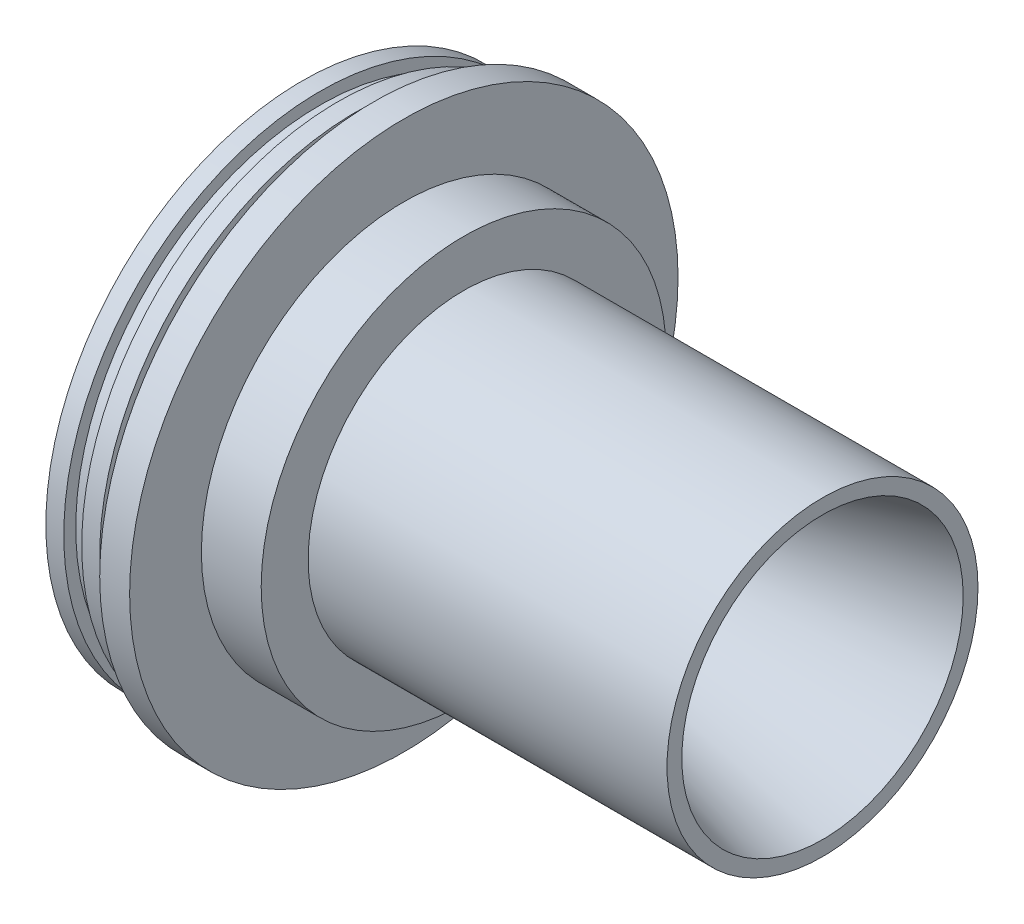
ISO-10303-21;
HEADER;
FILE_DESCRIPTION(('STEP AP214'),'2;1');
FILE_NAME('part.step','',(''),(''),'','','');
FILE_SCHEMA(('AUTOMOTIVE_DESIGN { 1 0 10303 214 1 1 1 1 }'));
ENDSEC;
DATA;
#1=APPLICATION_CONTEXT('core data for automotive mechanical design processes');
#2=APPLICATION_PROTOCOL_DEFINITION('international standard','automotive_design',2000,#1);
#3=PRODUCT_CONTEXT('',#1,'mechanical');
#4=PRODUCT('Part','Part','',(#3));
#5=PRODUCT_RELATED_PRODUCT_CATEGORY('part','',(#4));
#6=PRODUCT_DEFINITION_FORMATION('','',#4);
#7=PRODUCT_DEFINITION_CONTEXT('part definition',#1,'design');
#8=PRODUCT_DEFINITION('design','',#6,#7);
#9=PRODUCT_DEFINITION_SHAPE('','',#8);
#10=(LENGTH_UNIT() NAMED_UNIT(*) SI_UNIT(.MILLI.,.METRE.));
#11=(NAMED_UNIT(*) PLANE_ANGLE_UNIT() SI_UNIT($,.RADIAN.));
#12=(NAMED_UNIT(*) SI_UNIT($,.STERADIAN.) SOLID_ANGLE_UNIT());
#13=UNCERTAINTY_MEASURE_WITH_UNIT(LENGTH_MEASURE(1.E-05),#10,'distance_accuracy_value','');
#14=(GEOMETRIC_REPRESENTATION_CONTEXT(3) GLOBAL_UNCERTAINTY_ASSIGNED_CONTEXT((#13)) GLOBAL_UNIT_ASSIGNED_CONTEXT((#10,
#11,#12)) REPRESENTATION_CONTEXT('',''));
#15=CARTESIAN_POINT('',(0.,0.,0.));
#16=DIRECTION('',(0.,0.,1.));
#17=DIRECTION('',(1.,0.,0.));
#18=AXIS2_PLACEMENT_3D('',#15,#16,#17);
#19=CARTESIAN_POINT('',(-87.,42.86,0.));
#20=DIRECTION('',(-1.,0.,0.));
#21=DIRECTION('',(0.,0.,1.));
#22=AXIS2_PLACEMENT_3D('',#19,#20,#21);
#23=PLANE('',#22);
#24=CARTESIAN_POINT('',(-87.,0.,0.));
#25=DIRECTION('',(1.,0.,0.));
#26=DIRECTION('',(0.,0.,-1.));
#27=AXIS2_PLACEMENT_3D('',#24,#25,#26);
#28=CIRCLE('',#27,41.080611396612);
#29=CARTESIAN_POINT('',(-87.,0.,-41.080611396612));
#30=VERTEX_POINT('',#29);
#31=EDGE_CURVE('E10',#30,#30,#28,.T.);
#32=ORIENTED_EDGE('',*,*,#31,.T.);
#33=EDGE_LOOP('',(#32));
#34=FACE_BOUND('',#33,.T.);
#35=CARTESIAN_POINT('',(-87.,0.,0.));
#36=DIRECTION('',(1.,0.,0.));
#37=DIRECTION('',(0.,0.,-1.));
#38=AXIS2_PLACEMENT_3D('',#35,#36,#37);
#39=CIRCLE('',#38,42.86);
#40=CARTESIAN_POINT('',(-87.,0.,-42.86));
#41=VERTEX_POINT('',#40);
#42=EDGE_CURVE('E112',#41,#41,#39,.T.);
#43=ORIENTED_EDGE('',*,*,#42,.F.);
#44=EDGE_LOOP('',(#43));
#45=FACE_BOUND('',#44,.T.);
#46=ADVANCED_FACE('F37',(#34,#45),#23,.T.);
#47=CARTESIAN_POINT('',(-87.,0.,0.));
#48=DIRECTION('',(-1.,0.,0.));
#49=DIRECTION('',(0.,0.,1.));
#50=AXIS2_PLACEMENT_3D('',#47,#48,#49);
#51=CONICAL_SURFACE('',#50,41.080611396612,0.785398163397443);
#52=CARTESIAN_POINT('',(-60.8927868855894,0.,0.));
#53=DIRECTION('',(1.,0.,0.));
#54=DIRECTION('',(0.,0.,-1.));
#55=AXIS2_PLACEMENT_3D('',#52,#53,#54);
#56=CIRCLE('',#55,14.9733982822017);
#57=CARTESIAN_POINT('',(-60.8927868855894,0.,-14.9733982822017));
#58=VERTEX_POINT('',#57);
#59=EDGE_CURVE('E44',#58,#58,#56,.T.);
#60=ORIENTED_EDGE('',*,*,#59,.T.);
#61=EDGE_LOOP('',(#60));
#62=FACE_BOUND('',#61,.T.);
#63=ORIENTED_EDGE('',*,*,#31,.F.);
#64=EDGE_LOOP('',(#63));
#65=FACE_BOUND('',#64,.T.);
#66=ADVANCED_FACE('F121',(#62,#65),#51,.F.);
#67=CARTESIAN_POINT('',(-50.2861851677912,0.,0.));
#68=DIRECTION('',(1.,0.,0.));
#69=DIRECTION('',(0.,0.,-1.));
#70=AXIS2_PLACEMENT_3D('',#67,#68,#69);
#71=TOROIDAL_SURFACE('',#70,25.58,15.);
#72=CARTESIAN_POINT('',(-46.4038994912535,0.,0.));
#73=DIRECTION('',(1.,0.,0.));
#74=DIRECTION('',(0.,0.,-1.));
#75=AXIS2_PLACEMENT_3D('',#72,#73,#74);
#76=CIRCLE('',#75,11.0911126056639);
#77=CARTESIAN_POINT('',(-46.4038994912535,0.,-11.0911126056639));
#78=VERTEX_POINT('',#77);
#79=EDGE_CURVE('E49',#78,#78,#76,.T.);
#80=ORIENTED_EDGE('',*,*,#79,.T.);
#81=EDGE_LOOP('',(#80));
#82=FACE_BOUND('',#81,.T.);
#83=ORIENTED_EDGE('',*,*,#59,.F.);
#84=EDGE_LOOP('',(#83));
#85=FACE_BOUND('',#84,.T.);
#86=ADVANCED_FACE('F125',(#82,#85),#71,.T.);
#87=CARTESIAN_POINT('',(-46.4038994912535,0.,0.));
#88=DIRECTION('',(1.,0.,0.));
#89=DIRECTION('',(0.,0.,-1.));
#90=AXIS2_PLACEMENT_3D('',#87,#88,#89);
#91=CONICAL_SURFACE('',#90,11.0911126056639,0.261799387799143);
#92=CARTESIAN_POINT('',(0.,0.,0.));
#93=DIRECTION('',(1.,0.,0.));
#94=DIRECTION('',(0.,0.,-1.));
#95=AXIS2_PLACEMENT_3D('',#92,#93,#94);
#96=CIRCLE('',#95,23.525);
#97=CARTESIAN_POINT('',(0.,0.,-23.525));
#98=VERTEX_POINT('',#97);
#99=EDGE_CURVE('E54',#98,#98,#96,.T.);
#100=ORIENTED_EDGE('',*,*,#99,.T.);
#101=EDGE_LOOP('',(#100));
#102=FACE_BOUND('',#101,.T.);
#103=ORIENTED_EDGE('',*,*,#79,.F.);
#104=EDGE_LOOP('',(#103));
#105=FACE_BOUND('',#104,.T.);
#106=ADVANCED_FACE('F129',(#102,#105),#91,.F.);
#107=CARTESIAN_POINT('',(0.,23.525,0.));
#108=DIRECTION('',(1.,0.,0.));
#109=DIRECTION('',(0.,0.,-1.));
#110=AXIS2_PLACEMENT_3D('',#107,#108,#109);
#111=PLANE('',#110);
#112=CARTESIAN_POINT('',(0.,0.,0.));
#113=DIRECTION('',(1.,0.,0.));
#114=DIRECTION('',(0.,0.,-1.));
#115=AXIS2_PLACEMENT_3D('',#112,#113,#114);
#116=CIRCLE('',#115,26.);
#117=CARTESIAN_POINT('',(0.,0.,-26.));
#118=VERTEX_POINT('',#117);
#119=EDGE_CURVE('E60',#118,#118,#116,.T.);
#120=ORIENTED_EDGE('',*,*,#119,.T.);
#121=EDGE_LOOP('',(#120));
#122=FACE_BOUND('',#121,.T.);
#123=ORIENTED_EDGE('',*,*,#99,.F.);
#124=EDGE_LOOP('',(#123));
#125=FACE_BOUND('',#124,.T.);
#126=ADVANCED_FACE('F136',(#122,#125),#111,.T.);
#127=CARTESIAN_POINT('',(0.,0.,0.));
#128=DIRECTION('',(1.,0.,0.));
#129=DIRECTION('',(0.,0.,-1.));
#130=AXIS2_PLACEMENT_3D('',#127,#128,#129);
#131=CYLINDRICAL_SURFACE('',#130,26.);
#132=CARTESIAN_POINT('',(-60.,0.,0.));
#133=DIRECTION('',(1.,0.,0.));
#134=DIRECTION('',(0.,0.,-1.));
#135=AXIS2_PLACEMENT_3D('',#132,#133,#134);
#136=CIRCLE('',#135,26.);
#137=CARTESIAN_POINT('',(-60.,0.,-26.));
#138=VERTEX_POINT('',#137);
#139=EDGE_CURVE('E64',#138,#138,#136,.T.);
#140=ORIENTED_EDGE('',*,*,#139,.T.);
#141=EDGE_LOOP('',(#140));
#142=FACE_BOUND('',#141,.T.);
#143=ORIENTED_EDGE('',*,*,#119,.F.);
#144=EDGE_LOOP('',(#143));
#145=FACE_BOUND('',#144,.T.);
#146=ADVANCED_FACE('F140',(#142,#145),#131,.T.);
#147=CARTESIAN_POINT('',(-60.,33.85,0.));
#148=DIRECTION('',(1.,0.,0.));
#149=DIRECTION('',(0.,0.,-1.));
#150=AXIS2_PLACEMENT_3D('',#147,#148,#149);
#151=PLANE('',#150);
#152=CARTESIAN_POINT('',(-60.,0.,0.));
#153=DIRECTION('',(1.,0.,0.));
#154=DIRECTION('',(0.,0.,-1.));
#155=AXIS2_PLACEMENT_3D('',#152,#153,#154);
#156=CIRCLE('',#155,33.85);
#157=CARTESIAN_POINT('',(-60.,0.,-33.85));
#158=VERTEX_POINT('',#157);
#159=EDGE_CURVE('E68',#158,#158,#156,.T.);
#160=ORIENTED_EDGE('',*,*,#159,.T.);
#161=EDGE_LOOP('',(#160));
#162=FACE_BOUND('',#161,.T.);
#163=ORIENTED_EDGE('',*,*,#139,.F.);
#164=EDGE_LOOP('',(#163));
#165=FACE_BOUND('',#164,.T.);
#166=ADVANCED_FACE('F144',(#162,#165),#151,.T.);
#167=CARTESIAN_POINT('',(0.,0.,0.));
#168=DIRECTION('',(1.,0.,0.));
#169=DIRECTION('',(0.,0.,-1.));
#170=AXIS2_PLACEMENT_3D('',#167,#168,#169);
#171=CYLINDRICAL_SURFACE('',#170,33.85);
#172=CARTESIAN_POINT('',(-70.,0.,0.));
#173=DIRECTION('',(1.,0.,0.));
#174=DIRECTION('',(0.,0.,-1.));
#175=AXIS2_PLACEMENT_3D('',#172,#173,#174);
#176=CIRCLE('',#175,33.85);
#177=CARTESIAN_POINT('',(-70.,0.,-33.85));
#178=VERTEX_POINT('',#177);
#179=EDGE_CURVE('E72',#178,#178,#176,.T.);
#180=ORIENTED_EDGE('',*,*,#179,.T.);
#181=EDGE_LOOP('',(#180));
#182=FACE_BOUND('',#181,.T.);
#183=ORIENTED_EDGE('',*,*,#159,.F.);
#184=EDGE_LOOP('',(#183));
#185=FACE_BOUND('',#184,.T.);
#186=ADVANCED_FACE('F148',(#182,#185),#171,.T.);
#187=CARTESIAN_POINT('',(-70.,45.85,0.));
#188=DIRECTION('',(1.,0.,0.));
#189=DIRECTION('',(0.,0.,-1.));
#190=AXIS2_PLACEMENT_3D('',#187,#188,#189);
#191=PLANE('',#190);
#192=CARTESIAN_POINT('',(-70.,0.,0.));
#193=DIRECTION('',(1.,0.,0.));
#194=DIRECTION('',(0.,0.,-1.));
#195=AXIS2_PLACEMENT_3D('',#192,#193,#194);
#196=CIRCLE('',#195,45.85);
#197=CARTESIAN_POINT('',(-70.,0.,-45.85));
#198=VERTEX_POINT('',#197);
#199=EDGE_CURVE('E76',#198,#198,#196,.T.);
#200=ORIENTED_EDGE('',*,*,#199,.T.);
#201=EDGE_LOOP('',(#200));
#202=FACE_BOUND('',#201,.T.);
#203=ORIENTED_EDGE('',*,*,#179,.F.);
#204=EDGE_LOOP('',(#203));
#205=FACE_BOUND('',#204,.T.);
#206=ADVANCED_FACE('F152',(#202,#205),#191,.T.);
#207=CARTESIAN_POINT('',(0.,0.,0.));
#208=DIRECTION('',(1.,0.,0.));
#209=DIRECTION('',(0.,0.,-1.));
#210=AXIS2_PLACEMENT_3D('',#207,#208,#209);
#211=CYLINDRICAL_SURFACE('',#210,45.85);
#212=CARTESIAN_POINT('',(-75.,0.,0.));
#213=DIRECTION('',(1.,0.,0.));
#214=DIRECTION('',(0.,0.,-1.));
#215=AXIS2_PLACEMENT_3D('',#212,#213,#214);
#216=CIRCLE('',#215,45.85);
#217=CARTESIAN_POINT('',(-75.,0.,-45.85));
#218=VERTEX_POINT('',#217);
#219=EDGE_CURVE('E80',#218,#218,#216,.T.);
#220=ORIENTED_EDGE('',*,*,#219,.T.);
#221=EDGE_LOOP('',(#220));
#222=FACE_BOUND('',#221,.T.);
#223=ORIENTED_EDGE('',*,*,#199,.F.);
#224=EDGE_LOOP('',(#223));
#225=FACE_BOUND('',#224,.T.);
#226=ADVANCED_FACE('F156',(#222,#225),#211,.T.);
#227=CARTESIAN_POINT('',(-75.,45.85,0.));
#228=DIRECTION('',(-1.,0.,0.));
#229=DIRECTION('',(0.,0.,1.));
#230=AXIS2_PLACEMENT_3D('',#227,#228,#229);
#231=PLANE('',#230);
#232=CARTESIAN_POINT('',(-75.,0.,0.));
#233=DIRECTION('',(1.,0.,0.));
#234=DIRECTION('',(0.,0.,-1.));
#235=AXIS2_PLACEMENT_3D('',#232,#233,#234);
#236=CIRCLE('',#235,40.86);
#237=CARTESIAN_POINT('',(-75.,0.,-40.86));
#238=VERTEX_POINT('',#237);
#239=EDGE_CURVE('E84',#238,#238,#236,.T.);
#240=ORIENTED_EDGE('',*,*,#239,.T.);
#241=EDGE_LOOP('',(#240));
#242=FACE_BOUND('',#241,.T.);
#243=ORIENTED_EDGE('',*,*,#219,.F.);
#244=EDGE_LOOP('',(#243));
#245=FACE_BOUND('',#244,.T.);
#246=ADVANCED_FACE('F160',(#242,#245),#231,.T.);
#247=CARTESIAN_POINT('',(0.,0.,0.));
#248=DIRECTION('',(1.,0.,0.));
#249=DIRECTION('',(0.,0.,-1.));
#250=AXIS2_PLACEMENT_3D('',#247,#248,#249);
#251=CYLINDRICAL_SURFACE('',#250,40.86);
#252=CARTESIAN_POINT('',(-78.,0.,0.));
#253=DIRECTION('',(1.,0.,0.));
#254=DIRECTION('',(0.,0.,-1.));
#255=AXIS2_PLACEMENT_3D('',#252,#253,#254);
#256=CIRCLE('',#255,40.86);
#257=CARTESIAN_POINT('',(-78.,0.,-40.86));
#258=VERTEX_POINT('',#257);
#259=EDGE_CURVE('E88',#258,#258,#256,.T.);
#260=ORIENTED_EDGE('',*,*,#259,.T.);
#261=EDGE_LOOP('',(#260));
#262=FACE_BOUND('',#261,.T.);
#263=ORIENTED_EDGE('',*,*,#239,.F.);
#264=EDGE_LOOP('',(#263));
#265=FACE_BOUND('',#264,.T.);
#266=ADVANCED_FACE('F164',(#262,#265),#251,.T.);
#267=CARTESIAN_POINT('',(-78.,40.86,0.));
#268=DIRECTION('',(1.,0.,0.));
#269=DIRECTION('',(0.,0.,-1.));
#270=AXIS2_PLACEMENT_3D('',#267,#268,#269);
#271=PLANE('',#270);
#272=CARTESIAN_POINT('',(-78.,0.,0.));
#273=DIRECTION('',(1.,0.,0.));
#274=DIRECTION('',(0.,0.,-1.));
#275=AXIS2_PLACEMENT_3D('',#272,#273,#274);
#276=CIRCLE('',#275,42.86);
#277=CARTESIAN_POINT('',(-78.,0.,-42.86));
#278=VERTEX_POINT('',#277);
#279=EDGE_CURVE('E92',#278,#278,#276,.T.);
#280=ORIENTED_EDGE('',*,*,#279,.T.);
#281=EDGE_LOOP('',(#280));
#282=FACE_BOUND('',#281,.T.);
#283=ORIENTED_EDGE('',*,*,#259,.F.);
#284=EDGE_LOOP('',(#283));
#285=FACE_BOUND('',#284,.T.);
#286=ADVANCED_FACE('F168',(#282,#285),#271,.T.);
#287=CARTESIAN_POINT('',(0.,0.,0.));
#288=DIRECTION('',(1.,0.,0.));
#289=DIRECTION('',(0.,0.,-1.));
#290=AXIS2_PLACEMENT_3D('',#287,#288,#289);
#291=CYLINDRICAL_SURFACE('',#290,42.86);
#292=CARTESIAN_POINT('',(-81.,0.,0.));
#293=DIRECTION('',(1.,0.,0.));
#294=DIRECTION('',(0.,0.,-1.));
#295=AXIS2_PLACEMENT_3D('',#292,#293,#294);
#296=CIRCLE('',#295,42.86);
#297=CARTESIAN_POINT('',(-81.,0.,-42.86));
#298=VERTEX_POINT('',#297);
#299=EDGE_CURVE('E96',#298,#298,#296,.T.);
#300=ORIENTED_EDGE('',*,*,#299,.T.);
#301=EDGE_LOOP('',(#300));
#302=FACE_BOUND('',#301,.T.);
#303=ORIENTED_EDGE('',*,*,#279,.F.);
#304=EDGE_LOOP('',(#303));
#305=FACE_BOUND('',#304,.T.);
#306=ADVANCED_FACE('F172',(#302,#305),#291,.T.);
#307=CARTESIAN_POINT('',(-81.,42.86,0.));
#308=DIRECTION('',(-1.,0.,0.));
#309=DIRECTION('',(0.,0.,1.));
#310=AXIS2_PLACEMENT_3D('',#307,#308,#309);
#311=PLANE('',#310);
#312=CARTESIAN_POINT('',(-81.,0.,0.));
#313=DIRECTION('',(1.,0.,0.));
#314=DIRECTION('',(0.,0.,-1.));
#315=AXIS2_PLACEMENT_3D('',#312,#313,#314);
#316=CIRCLE('',#315,40.86);
#317=CARTESIAN_POINT('',(-81.,0.,-40.86));
#318=VERTEX_POINT('',#317);
#319=EDGE_CURVE('E100',#318,#318,#316,.T.);
#320=ORIENTED_EDGE('',*,*,#319,.T.);
#321=EDGE_LOOP('',(#320));
#322=FACE_BOUND('',#321,.T.);
#323=ORIENTED_EDGE('',*,*,#299,.F.);
#324=EDGE_LOOP('',(#323));
#325=FACE_BOUND('',#324,.T.);
#326=ADVANCED_FACE('F176',(#322,#325),#311,.T.);
#327=CARTESIAN_POINT('',(0.,0.,0.));
#328=DIRECTION('',(1.,0.,0.));
#329=DIRECTION('',(0.,0.,-1.));
#330=AXIS2_PLACEMENT_3D('',#327,#328,#329);
#331=CYLINDRICAL_SURFACE('',#330,40.86);
#332=CARTESIAN_POINT('',(-84.,0.,0.));
#333=DIRECTION('',(1.,0.,0.));
#334=DIRECTION('',(0.,0.,-1.));
#335=AXIS2_PLACEMENT_3D('',#332,#333,#334);
#336=CIRCLE('',#335,40.86);
#337=CARTESIAN_POINT('',(-84.,0.,-40.86));
#338=VERTEX_POINT('',#337);
#339=EDGE_CURVE('E104',#338,#338,#336,.T.);
#340=ORIENTED_EDGE('',*,*,#339,.T.);
#341=EDGE_LOOP('',(#340));
#342=FACE_BOUND('',#341,.T.);
#343=ORIENTED_EDGE('',*,*,#319,.F.);
#344=EDGE_LOOP('',(#343));
#345=FACE_BOUND('',#344,.T.);
#346=ADVANCED_FACE('F180',(#342,#345),#331,.T.);
#347=CARTESIAN_POINT('',(-84.,40.86,0.));
#348=DIRECTION('',(1.,0.,0.));
#349=DIRECTION('',(0.,0.,-1.));
#350=AXIS2_PLACEMENT_3D('',#347,#348,#349);
#351=PLANE('',#350);
#352=CARTESIAN_POINT('',(-84.,0.,0.));
#353=DIRECTION('',(1.,0.,0.));
#354=DIRECTION('',(0.,0.,-1.));
#355=AXIS2_PLACEMENT_3D('',#352,#353,#354);
#356=CIRCLE('',#355,42.86);
#357=CARTESIAN_POINT('',(-84.,0.,-42.86));
#358=VERTEX_POINT('',#357);
#359=EDGE_CURVE('E108',#358,#358,#356,.T.);
#360=ORIENTED_EDGE('',*,*,#359,.T.);
#361=EDGE_LOOP('',(#360));
#362=FACE_BOUND('',#361,.T.);
#363=ORIENTED_EDGE('',*,*,#339,.F.);
#364=EDGE_LOOP('',(#363));
#365=FACE_BOUND('',#364,.T.);
#366=ADVANCED_FACE('F184',(#362,#365),#351,.T.);
#367=CARTESIAN_POINT('',(0.,0.,0.));
#368=DIRECTION('',(1.,0.,0.));
#369=DIRECTION('',(0.,0.,-1.));
#370=AXIS2_PLACEMENT_3D('',#367,#368,#369);
#371=CYLINDRICAL_SURFACE('',#370,42.86);
#372=ORIENTED_EDGE('',*,*,#42,.T.);
#373=EDGE_LOOP('',(#372));
#374=FACE_BOUND('',#373,.T.);
#375=ORIENTED_EDGE('',*,*,#359,.F.);
#376=EDGE_LOOP('',(#375));
#377=FACE_BOUND('',#376,.T.);
#378=ADVANCED_FACE('F117',(#374,#377),#371,.T.);
#379=CLOSED_SHELL('',(#46,#66,#86,#106,#126,#146,#166,#186,#206,#226,#246,#266,#286,#306,#326,
#346,#366,#378));
#380=MANIFOLD_SOLID_BREP('B2',#379);
#381=ADVANCED_BREP_SHAPE_REPRESENTATION('',(#18,#380),#14);
#382=SHAPE_DEFINITION_REPRESENTATION(#9,#381);
ENDSEC;
END-ISO-10303-21;
